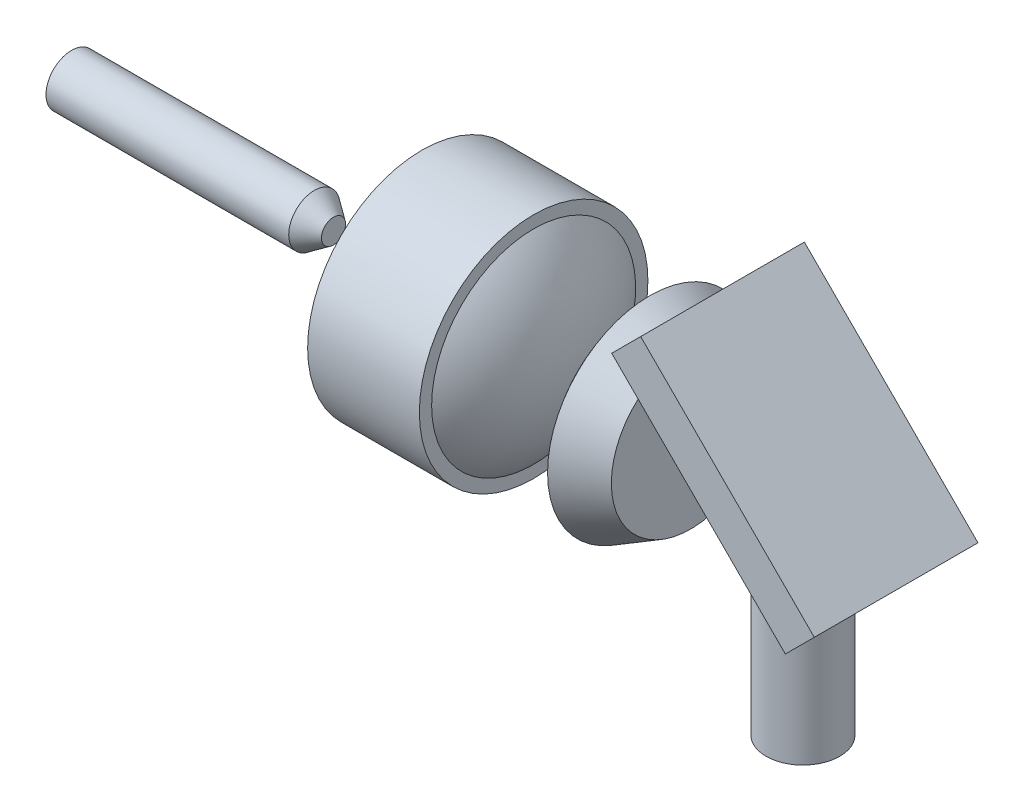
ISO-10303-21;
HEADER;
FILE_DESCRIPTION(('STEP AP214'),'2;1');
FILE_NAME('part.step','',(''),(''),'','','');
FILE_SCHEMA(('AUTOMOTIVE_DESIGN { 1 0 10303 214 1 1 1 1 }'));
ENDSEC;
DATA;
#1=APPLICATION_CONTEXT('core data for automotive mechanical design processes');
#2=APPLICATION_PROTOCOL_DEFINITION('international standard','automotive_design',2000,#1);
#3=PRODUCT_CONTEXT('',#1,'mechanical');
#4=PRODUCT('Part','Part','',(#3));
#5=PRODUCT_RELATED_PRODUCT_CATEGORY('part','',(#4));
#6=PRODUCT_DEFINITION_FORMATION('','',#4);
#7=PRODUCT_DEFINITION_CONTEXT('part definition',#1,'design');
#8=PRODUCT_DEFINITION('design','',#6,#7);
#9=PRODUCT_DEFINITION_SHAPE('','',#8);
#10=(LENGTH_UNIT() NAMED_UNIT(*) SI_UNIT(.MILLI.,.METRE.));
#11=(NAMED_UNIT(*) PLANE_ANGLE_UNIT() SI_UNIT($,.RADIAN.));
#12=(NAMED_UNIT(*) SI_UNIT($,.STERADIAN.) SOLID_ANGLE_UNIT());
#13=UNCERTAINTY_MEASURE_WITH_UNIT(LENGTH_MEASURE(1.E-05),#10,'distance_accuracy_value','');
#14=(GEOMETRIC_REPRESENTATION_CONTEXT(3) GLOBAL_UNCERTAINTY_ASSIGNED_CONTEXT((#13)) GLOBAL_UNIT_ASSIGNED_CONTEXT((#10,
#11,#12)) REPRESENTATION_CONTEXT('',''));
#15=CARTESIAN_POINT('',(0.,0.,0.));
#16=DIRECTION('',(0.,0.,1.));
#17=DIRECTION('',(1.,0.,0.));
#18=AXIS2_PLACEMENT_3D('',#15,#16,#17);
#19=CARTESIAN_POINT('',(0.,-1.,0.));
#20=DIRECTION('',(0.,1.,0.));
#21=DIRECTION('',(0.,0.,1.));
#22=AXIS2_PLACEMENT_3D('',#19,#20,#21);
#23=PLANE('',#22);
#24=CARTESIAN_POINT('',(18.8699999999995,-1.,0.));
#25=DIRECTION('',(0.,1.,0.));
#26=DIRECTION('',(0.,0.,1.));
#27=AXIS2_PLACEMENT_3D('',#24,#25,#26);
#28=CIRCLE('',#27,0.900000000000001);
#29=CARTESIAN_POINT('',(18.8699999999995,-1.,0.900000000000001));
#30=VERTEX_POINT('',#29);
#31=EDGE_CURVE('E11',#30,#30,#28,.T.);
#32=ORIENTED_EDGE('',*,*,#31,.T.);
#33=EDGE_LOOP('',(#32));
#34=FACE_BOUND('',#33,.T.);
#35=ADVANCED_FACE('F42',(#34),#23,.T.);
#36=CARTESIAN_POINT('',(18.8699999999995,-1.,0.));
#37=DIRECTION('',(0.,1.,0.));
#38=DIRECTION('',(0.,0.,1.));
#39=AXIS2_PLACEMENT_3D('',#36,#37,#38);
#40=CYLINDRICAL_SURFACE('',#39,0.900000000000003);
#41=CARTESIAN_POINT('',(18.8699999999995,-4.93,0.));
#42=DIRECTION('',(0.,1.,0.));
#43=DIRECTION('',(0.,0.,1.));
#44=AXIS2_PLACEMENT_3D('',#41,#42,#43);
#45=CIRCLE('',#44,0.900000000000005);
#46=CARTESIAN_POINT('',(18.8699999999995,-4.93,0.900000000000005));
#47=VERTEX_POINT('',#46);
#48=EDGE_CURVE('E48',#47,#47,#45,.T.);
#49=ORIENTED_EDGE('',*,*,#48,.T.);
#50=EDGE_LOOP('',(#49));
#51=FACE_BOUND('',#50,.T.);
#52=ORIENTED_EDGE('',*,*,#31,.F.);
#53=EDGE_LOOP('',(#52));
#54=FACE_BOUND('',#53,.T.);
#55=ADVANCED_FACE('F54',(#51,#54),#40,.T.);
#56=CARTESIAN_POINT('',(0.,-4.93,0.));
#57=DIRECTION('',(0.,1.,0.));
#58=DIRECTION('',(0.,0.,1.));
#59=AXIS2_PLACEMENT_3D('',#56,#57,#58);
#60=PLANE('',#59);
#61=ORIENTED_EDGE('',*,*,#48,.F.);
#62=EDGE_LOOP('',(#61));
#63=FACE_BOUND('',#62,.T.);
#64=ADVANCED_FACE('F57',(#63),#60,.F.);
#65=CLOSED_SHELL('',(#35,#55,#64));
#66=MANIFOLD_SOLID_BREP('B2',#65);
#67=CARTESIAN_POINT('',(18.286954022988,0.,0.));
#68=DIRECTION('',(-1.,0.,0.));
#69=DIRECTION('',(0.,1.,0.));
#70=AXIS2_PLACEMENT_3D('',#67,#68,#69);
#71=SPHERICAL_SURFACE('',#70,4.02695402298851);
#72=CARTESIAN_POINT('',(15.1299999999995,0.,0.));
#73=DIRECTION('',(-1.,0.,0.));
#74=DIRECTION('',(0.,0.,1.));
#75=AXIS2_PLACEMENT_3D('',#72,#73,#74);
#76=CIRCLE('',#75,2.5);
#77=CARTESIAN_POINT('',(15.1299999999995,0.,2.5));
#78=VERTEX_POINT('',#77);
#79=EDGE_CURVE('E97',#78,#78,#76,.T.);
#80=ORIENTED_EDGE('',*,*,#79,.T.);
#81=EDGE_LOOP('',(#80));
#82=FACE_BOUND('',#81,.T.);
#83=ADVANCED_FACE('F91',(#82),#71,.T.);
#84=CARTESIAN_POINT('',(16.1299999999995,0.,0.));
#85=DIRECTION('',(-1.,0.,0.));
#86=DIRECTION('',(0.,0.,1.));
#87=AXIS2_PLACEMENT_3D('',#84,#85,#86);
#88=PLANE('',#87);
#89=CARTESIAN_POINT('',(16.1299999999995,0.,0.));
#90=DIRECTION('',(-1.,0.,0.));
#91=DIRECTION('',(0.,0.,1.));
#92=AXIS2_PLACEMENT_3D('',#89,#90,#91);
#93=CIRCLE('',#92,1.94084592427906);
#94=CARTESIAN_POINT('',(16.1299999999995,0.,1.94084592427906));
#95=VERTEX_POINT('',#94);
#96=EDGE_CURVE('E41',#95,#95,#93,.T.);
#97=ORIENTED_EDGE('',*,*,#96,.F.);
#98=EDGE_LOOP('',(#97));
#99=FACE_BOUND('',#98,.T.);
#100=ADVANCED_FACE('F106',(#99),#88,.F.);
#101=CARTESIAN_POINT('',(15.1299999999995,0.,0.));
#102=DIRECTION('',(-1.,0.,0.));
#103=DIRECTION('',(0.,0.,1.));
#104=AXIS2_PLACEMENT_3D('',#101,#102,#103);
#105=CONICAL_SURFACE('',#104,2.5,0.509844115663822);
#106=ORIENTED_EDGE('',*,*,#96,.T.);
#107=EDGE_LOOP('',(#106));
#108=FACE_BOUND('',#107,.T.);
#109=ORIENTED_EDGE('',*,*,#79,.F.);
#110=EDGE_LOOP('',(#109));
#111=FACE_BOUND('',#110,.T.);
#112=ADVANCED_FACE('F104',(#108,#111),#105,.T.);
#113=CLOSED_SHELL('',(#83,#100,#112));
#114=MANIFOLD_SOLID_BREP('B6',#113);
#115=CARTESIAN_POINT('',(9.57265141752345,0.,0.));
#116=DIRECTION('',(-1.,0.,0.));
#117=DIRECTION('',(0.,1.,0.));
#118=AXIS2_PLACEMENT_3D('',#115,#116,#117);
#119=SPHERICAL_SURFACE('',#118,3.68734858247576);
#120=CARTESIAN_POINT('',(12.29,0.,0.));
#121=DIRECTION('',(-1.,0.,0.));
#122=DIRECTION('',(0.,0.,1.));
#123=AXIS2_PLACEMENT_3D('',#120,#121,#122);
#124=CIRCLE('',#123,2.4925);
#125=CARTESIAN_POINT('',(12.29,0.,2.4925));
#126=VERTEX_POINT('',#125);
#127=EDGE_CURVE('E90',#126,#126,#124,.T.);
#128=ORIENTED_EDGE('',*,*,#127,.F.);
#129=EDGE_LOOP('',(#128));
#130=FACE_BOUND('',#129,.T.);
#131=ADVANCED_FACE('F140',(#130),#119,.T.);
#132=CARTESIAN_POINT('',(12.2899999999998,1.98984347517778E-11,0.));
#133=DIRECTION('',(1.,0.,0.));
#134=DIRECTION('',(0.,0.,-1.));
#135=AXIS2_PLACEMENT_3D('',#132,#133,#134);
#136=PLANE('',#135);
#137=ORIENTED_EDGE('',*,*,#127,.T.);
#138=EDGE_LOOP('',(#137));
#139=FACE_BOUND('',#138,.T.);
#140=CARTESIAN_POINT('',(12.2899999999995,0.,0.));
#141=DIRECTION('',(-1.,0.,0.));
#142=DIRECTION('',(0.,0.,1.));
#143=AXIS2_PLACEMENT_3D('',#140,#141,#142);
#144=CIRCLE('',#143,2.7925);
#145=CARTESIAN_POINT('',(12.2899999999995,0.,2.7925));
#146=VERTEX_POINT('',#145);
#147=EDGE_CURVE('E146',#146,#146,#144,.T.);
#148=ORIENTED_EDGE('',*,*,#147,.F.);
#149=EDGE_LOOP('',(#148));
#150=FACE_BOUND('',#149,.T.);
#151=ADVANCED_FACE('F161',(#139,#150),#136,.T.);
#152=CARTESIAN_POINT('',(0.,0.,0.));
#153=DIRECTION('',(-1.,0.,0.));
#154=DIRECTION('',(0.,0.,1.));
#155=AXIS2_PLACEMENT_3D('',#152,#153,#154);
#156=CYLINDRICAL_SURFACE('',#155,2.7925);
#157=CARTESIAN_POINT('',(9.56,0.,0.));
#158=DIRECTION('',(-1.,0.,0.));
#159=DIRECTION('',(0.,0.,1.));
#160=AXIS2_PLACEMENT_3D('',#157,#158,#159);
#161=CIRCLE('',#160,2.7925);
#162=CARTESIAN_POINT('',(9.56,0.,2.7925));
#163=VERTEX_POINT('',#162);
#164=EDGE_CURVE('E150',#163,#163,#161,.T.);
#165=ORIENTED_EDGE('',*,*,#164,.F.);
#166=EDGE_LOOP('',(#165));
#167=FACE_BOUND('',#166,.T.);
#168=ORIENTED_EDGE('',*,*,#147,.T.);
#169=EDGE_LOOP('',(#168));
#170=FACE_BOUND('',#169,.T.);
#171=ADVANCED_FACE('F159',(#167,#170),#156,.T.);
#172=CARTESIAN_POINT('',(9.56,0.,0.));
#173=DIRECTION('',(-1.,0.,0.));
#174=DIRECTION('',(0.,0.,1.));
#175=AXIS2_PLACEMENT_3D('',#172,#173,#174);
#176=PLANE('',#175);
#177=ORIENTED_EDGE('',*,*,#164,.T.);
#178=EDGE_LOOP('',(#177));
#179=FACE_BOUND('',#178,.T.);
#180=ADVANCED_FACE('F157',(#179),#176,.T.);
#181=CLOSED_SHELL('',(#131,#151,#171,#180));
#182=MANIFOLD_SOLID_BREP('B36',#181);
#183=CARTESIAN_POINT('',(6.93063867622447,0.,0.));
#184=DIRECTION('',(-1.,0.,0.));
#185=DIRECTION('',(0.,0.,1.));
#186=AXIS2_PLACEMENT_3D('',#183,#184,#185);
#187=CONICAL_SURFACE('',#186,0.625000000000001,0.613291113378778);
#188=CARTESIAN_POINT('',(7.4,0.,0.));
#189=DIRECTION('',(-1.,0.,0.));
#190=DIRECTION('',(0.,0.,1.));
#191=AXIS2_PLACEMENT_3D('',#188,#189,#190);
#192=CIRCLE('',#191,0.294649909649603);
#193=CARTESIAN_POINT('',(7.4,0.,0.294649909649603));
#194=VERTEX_POINT('',#193);
#195=EDGE_CURVE('E215',#194,#194,#192,.T.);
#196=ORIENTED_EDGE('',*,*,#195,.T.);
#197=EDGE_LOOP('',(#196));
#198=FACE_BOUND('',#197,.T.);
#199=CARTESIAN_POINT('',(6.93063867622447,0.,0.));
#200=DIRECTION('',(-1.,0.,0.));
#201=DIRECTION('',(0.,0.,1.));
#202=AXIS2_PLACEMENT_3D('',#199,#200,#201);
#203=CIRCLE('',#202,0.625000000000001);
#204=CARTESIAN_POINT('',(6.93063867622447,0.,0.625000000000001));
#205=VERTEX_POINT('',#204);
#206=EDGE_CURVE('E139',#205,#205,#203,.T.);
#207=ORIENTED_EDGE('',*,*,#206,.F.);
#208=EDGE_LOOP('',(#207));
#209=FACE_BOUND('',#208,.T.);
#210=ADVANCED_FACE('F205',(#198,#209),#187,.T.);
#211=CARTESIAN_POINT('',(0.,0.,0.));
#212=DIRECTION('',(-1.,0.,0.));
#213=DIRECTION('',(0.,0.,1.));
#214=AXIS2_PLACEMENT_3D('',#211,#212,#213);
#215=CYLINDRICAL_SURFACE('',#214,0.625);
#216=CARTESIAN_POINT('',(1.,0.,0.));
#217=DIRECTION('',(-1.,0.,0.));
#218=DIRECTION('',(0.,0.,1.));
#219=AXIS2_PLACEMENT_3D('',#216,#217,#218);
#220=CIRCLE('',#219,0.625);
#221=CARTESIAN_POINT('',(1.,0.,0.625));
#222=VERTEX_POINT('',#221);
#223=EDGE_CURVE('E211',#222,#222,#220,.T.);
#224=ORIENTED_EDGE('',*,*,#223,.F.);
#225=EDGE_LOOP('',(#224));
#226=FACE_BOUND('',#225,.T.);
#227=ORIENTED_EDGE('',*,*,#206,.T.);
#228=EDGE_LOOP('',(#227));
#229=FACE_BOUND('',#228,.T.);
#230=ADVANCED_FACE('F231',(#226,#229),#215,.T.);
#231=CARTESIAN_POINT('',(1.,0.,0.));
#232=DIRECTION('',(-1.,0.,0.));
#233=DIRECTION('',(0.,0.,1.));
#234=AXIS2_PLACEMENT_3D('',#231,#232,#233);
#235=PLANE('',#234);
#236=ORIENTED_EDGE('',*,*,#223,.T.);
#237=EDGE_LOOP('',(#236));
#238=FACE_BOUND('',#237,.T.);
#239=ADVANCED_FACE('F226',(#238),#235,.T.);
#240=CARTESIAN_POINT('',(7.4,0.,0.));
#241=DIRECTION('',(-1.,0.,0.));
#242=DIRECTION('',(0.,0.,1.));
#243=AXIS2_PLACEMENT_3D('',#240,#241,#242);
#244=PLANE('',#243);
#245=ORIENTED_EDGE('',*,*,#195,.F.);
#246=EDGE_LOOP('',(#245));
#247=FACE_BOUND('',#246,.T.);
#248=ADVANCED_FACE('F224',(#247),#244,.F.);
#249=CLOSED_SHELL('',(#210,#230,#239,#248));
#250=MANIFOLD_SOLID_BREP('B85',#249);
#251=CARTESIAN_POINT('',(20.4407106781182,-1.42928932188134,2.));
#252=DIRECTION('',(-0.707106781186543,-0.707106781186552,0.));
#253=DIRECTION('',(0.707106781186552,-0.707106781186543,0.));
#254=AXIS2_PLACEMENT_3D('',#251,#252,#253);
#255=PLANE('',#254);
#256=DIRECTION('',(-0.707106781186552,0.707106781186543,0.));
#257=VECTOR('',#256,1.);
#258=CARTESIAN_POINT('',(20.4407106781182,-1.42928932188134,-2.));
#259=LINE('',#258,#257);
#260=CARTESIAN_POINT('',(20.4407106781182,-1.42928932188134,-2.));
#261=VERTEX_POINT('',#260);
#262=CARTESIAN_POINT('',(16.1980699909989,2.81335136523792,-2.));
#263=VERTEX_POINT('',#262);
#264=EDGE_CURVE('E326',#261,#263,#259,.T.);
#265=ORIENTED_EDGE('',*,*,#264,.F.);
#266=DIRECTION('',(0.,0.,-1.));
#267=VECTOR('',#266,1.);
#268=CARTESIAN_POINT('',(20.4407106781182,-1.42928932188134,2.));
#269=LINE('',#268,#267);
#270=CARTESIAN_POINT('',(20.4407106781182,-1.42928932188134,2.));
#271=VERTEX_POINT('',#270);
#272=EDGE_CURVE('E203',#271,#261,#269,.T.);
#273=ORIENTED_EDGE('',*,*,#272,.F.);
#274=DIRECTION('',(-0.707106781186552,0.707106781186543,0.));
#275=VECTOR('',#274,1.);
#276=CARTESIAN_POINT('',(20.4407106781182,-1.42928932188134,2.));
#277=LINE('',#276,#275);
#278=CARTESIAN_POINT('',(16.1980699909989,2.81335136523792,2.));
#279=VERTEX_POINT('',#278);
#280=EDGE_CURVE('E321',#271,#279,#277,.T.);
#281=ORIENTED_EDGE('',*,*,#280,.T.);
#282=DIRECTION('',(0.,0.,-1.));
#283=VECTOR('',#282,1.);
#284=CARTESIAN_POINT('',(16.1980699909989,2.81335136523792,2.));
#285=LINE('',#284,#283);
#286=EDGE_CURVE('E264',#279,#263,#285,.T.);
#287=ORIENTED_EDGE('',*,*,#286,.T.);
#288=EDGE_LOOP('',(#265,#273,#281,#287));
#289=FACE_BOUND('',#288,.T.);
#290=ADVANCED_FACE('F261',(#289),#255,.T.);
#291=CARTESIAN_POINT('',(20.4407106781182,-1.42928932188134,2.));
#292=DIRECTION('',(-0.707106781186554,0.707106781186541,0.));
#293=DIRECTION('',(-0.707106781186541,-0.707106781186554,0.));
#294=AXIS2_PLACEMENT_3D('',#291,#292,#293);
#295=PLANE('',#294);
#296=DIRECTION('',(0.707106781186541,0.707106781186554,0.));
#297=VECTOR('',#296,1.);
#298=CARTESIAN_POINT('',(20.4407106781182,-1.42928932188134,-2.));
#299=LINE('',#298,#297);
#300=CARTESIAN_POINT('',(21.1478174593047,-0.72218254069479,-2.));
#301=VERTEX_POINT('',#300);
#302=EDGE_CURVE('E294',#261,#301,#299,.T.);
#303=ORIENTED_EDGE('',*,*,#302,.T.);
#304=DIRECTION('',(0.,0.,-1.));
#305=VECTOR('',#304,1.);
#306=CARTESIAN_POINT('',(21.1478174593047,-0.72218254069479,2.));
#307=LINE('',#306,#305);
#308=CARTESIAN_POINT('',(21.1478174593047,-0.72218254069479,2.));
#309=VERTEX_POINT('',#308);
#310=EDGE_CURVE('E270',#309,#301,#307,.T.);
#311=ORIENTED_EDGE('',*,*,#310,.F.);
#312=DIRECTION('',(0.707106781186541,0.707106781186554,0.));
#313=VECTOR('',#312,1.);
#314=CARTESIAN_POINT('',(20.4407106781182,-1.42928932188134,2.));
#315=LINE('',#314,#313);
#316=EDGE_CURVE('E311',#271,#309,#315,.T.);
#317=ORIENTED_EDGE('',*,*,#316,.F.);
#318=ORIENTED_EDGE('',*,*,#272,.T.);
#319=EDGE_LOOP('',(#303,#311,#317,#318));
#320=FACE_BOUND('',#319,.T.);
#321=ADVANCED_FACE('F336',(#320),#295,.F.);
#322=CARTESIAN_POINT('',(21.1478174593047,-0.72218254069479,2.));
#323=DIRECTION('',(-0.707106781186544,-0.707106781186551,0.));
#324=DIRECTION('',(0.707106781186551,-0.707106781186544,0.));
#325=AXIS2_PLACEMENT_3D('',#322,#323,#324);
#326=PLANE('',#325);
#327=DIRECTION('',(-0.707106781186551,0.707106781186544,0.));
#328=VECTOR('',#327,1.);
#329=CARTESIAN_POINT('',(21.1478174593047,-0.72218254069479,-2.));
#330=LINE('',#329,#328);
#331=CARTESIAN_POINT('',(16.9051767721854,3.52045814642447,-2.));
#332=VERTEX_POINT('',#331);
#333=EDGE_CURVE('E318',#301,#332,#330,.T.);
#334=ORIENTED_EDGE('',*,*,#333,.T.);
#335=DIRECTION('',(0.,0.,-1.));
#336=VECTOR('',#335,1.);
#337=CARTESIAN_POINT('',(16.9051767721854,3.52045814642447,2.));
#338=LINE('',#337,#336);
#339=CARTESIAN_POINT('',(16.9051767721854,3.52045814642447,2.));
#340=VERTEX_POINT('',#339);
#341=EDGE_CURVE('E315',#340,#332,#338,.T.);
#342=ORIENTED_EDGE('',*,*,#341,.F.);
#343=DIRECTION('',(-0.707106781186551,0.707106781186544,0.));
#344=VECTOR('',#343,1.);
#345=CARTESIAN_POINT('',(21.1478174593047,-0.72218254069479,2.));
#346=LINE('',#345,#344);
#347=EDGE_CURVE('E306',#309,#340,#346,.T.);
#348=ORIENTED_EDGE('',*,*,#347,.F.);
#349=ORIENTED_EDGE('',*,*,#310,.T.);
#350=EDGE_LOOP('',(#334,#342,#348,#349));
#351=FACE_BOUND('',#350,.T.);
#352=ADVANCED_FACE('F316',(#351),#326,.F.);
#353=CARTESIAN_POINT('',(16.1980699909989,2.81335136523792,2.));
#354=DIRECTION('',(-0.707106781186552,0.707106781186543,0.));
#355=DIRECTION('',(-0.707106781186543,-0.707106781186552,0.));
#356=AXIS2_PLACEMENT_3D('',#353,#354,#355);
#357=PLANE('',#356);
#358=DIRECTION('',(0.707106781186543,0.707106781186552,0.));
#359=VECTOR('',#358,1.);
#360=CARTESIAN_POINT('',(16.1980699909989,2.81335136523792,-2.));
#361=LINE('',#360,#359);
#362=EDGE_CURVE('E329',#263,#332,#361,.T.);
#363=ORIENTED_EDGE('',*,*,#362,.F.);
#364=ORIENTED_EDGE('',*,*,#286,.F.);
#365=DIRECTION('',(0.707106781186543,0.707106781186552,0.));
#366=VECTOR('',#365,1.);
#367=CARTESIAN_POINT('',(16.1980699909989,2.81335136523792,2.));
#368=LINE('',#367,#366);
#369=EDGE_CURVE('E310',#279,#340,#368,.T.);
#370=ORIENTED_EDGE('',*,*,#369,.T.);
#371=ORIENTED_EDGE('',*,*,#341,.T.);
#372=EDGE_LOOP('',(#363,#364,#370,#371));
#373=FACE_BOUND('',#372,.T.);
#374=ADVANCED_FACE('F320',(#373),#357,.T.);
#375=CARTESIAN_POINT('',(0.,0.,2.));
#376=DIRECTION('',(0.,0.,-1.));
#377=DIRECTION('',(-1.,0.,0.));
#378=AXIS2_PLACEMENT_3D('',#375,#376,#377);
#379=PLANE('',#378);
#380=ORIENTED_EDGE('',*,*,#280,.F.);
#381=ORIENTED_EDGE('',*,*,#316,.T.);
#382=ORIENTED_EDGE('',*,*,#347,.T.);
#383=ORIENTED_EDGE('',*,*,#369,.F.);
#384=EDGE_LOOP('',(#380,#381,#382,#383));
#385=FACE_BOUND('',#384,.T.);
#386=ADVANCED_FACE('F309',(#385),#379,.F.);
#387=CARTESIAN_POINT('',(0.,0.,-2.));
#388=DIRECTION('',(0.,0.,-1.));
#389=DIRECTION('',(-1.,0.,0.));
#390=AXIS2_PLACEMENT_3D('',#387,#388,#389);
#391=PLANE('',#390);
#392=ORIENTED_EDGE('',*,*,#264,.T.);
#393=ORIENTED_EDGE('',*,*,#362,.T.);
#394=ORIENTED_EDGE('',*,*,#333,.F.);
#395=ORIENTED_EDGE('',*,*,#302,.F.);
#396=EDGE_LOOP('',(#392,#393,#394,#395));
#397=FACE_BOUND('',#396,.T.);
#398=ADVANCED_FACE('F334',(#397),#391,.T.);
#399=CLOSED_SHELL('',(#290,#321,#352,#374,#386,#398));
#400=MANIFOLD_SOLID_BREP('B134',#399);
#401=ADVANCED_BREP_SHAPE_REPRESENTATION('',(#18,#66,#114,#182,#250,#400),#14);
#402=SHAPE_DEFINITION_REPRESENTATION(#9,#401);
ENDSEC;
END-ISO-10303-21;
